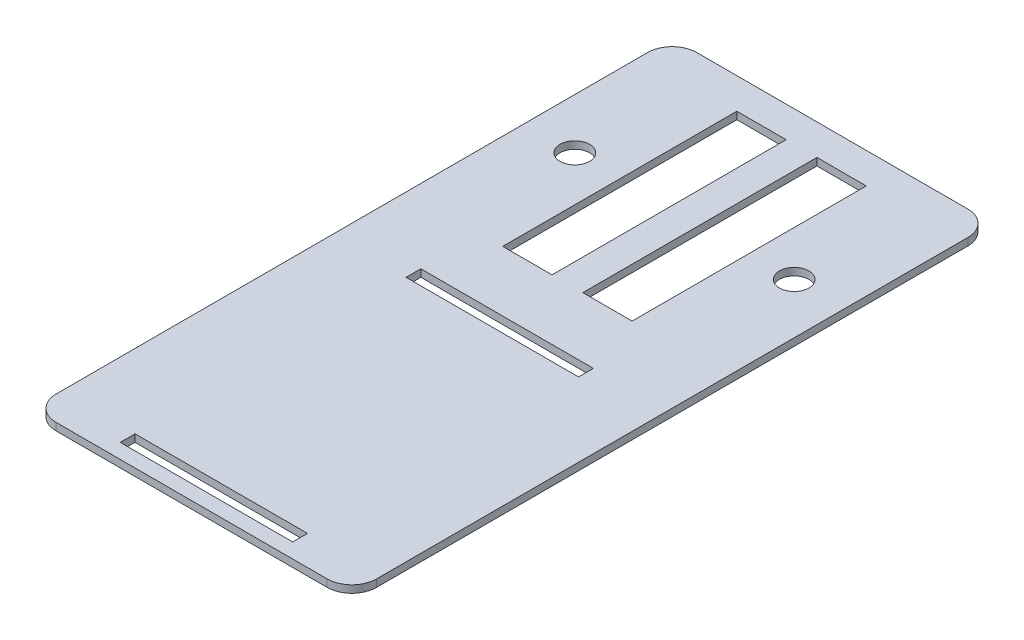
ISO-10303-21;
HEADER;
FILE_DESCRIPTION(('STEP AP214'),'2;1');
FILE_NAME('part.step','',(''),(''),'','','');
FILE_SCHEMA(('AUTOMOTIVE_DESIGN { 1 0 10303 214 1 1 1 1 }'));
ENDSEC;
DATA;
#1=APPLICATION_CONTEXT('core data for automotive mechanical design processes');
#2=APPLICATION_PROTOCOL_DEFINITION('international standard','automotive_design',2000,#1);
#3=PRODUCT_CONTEXT('',#1,'mechanical');
#4=PRODUCT('Part','Part','',(#3));
#5=PRODUCT_RELATED_PRODUCT_CATEGORY('part','',(#4));
#6=PRODUCT_DEFINITION_FORMATION('','',#4);
#7=PRODUCT_DEFINITION_CONTEXT('part definition',#1,'design');
#8=PRODUCT_DEFINITION('design','',#6,#7);
#9=PRODUCT_DEFINITION_SHAPE('','',#8);
#10=(LENGTH_UNIT() NAMED_UNIT(*) SI_UNIT(.MILLI.,.METRE.));
#11=(NAMED_UNIT(*) PLANE_ANGLE_UNIT() SI_UNIT($,.RADIAN.));
#12=(NAMED_UNIT(*) SI_UNIT($,.STERADIAN.) SOLID_ANGLE_UNIT());
#13=UNCERTAINTY_MEASURE_WITH_UNIT(LENGTH_MEASURE(1.E-05),#10,'distance_accuracy_value','');
#14=(GEOMETRIC_REPRESENTATION_CONTEXT(3) GLOBAL_UNCERTAINTY_ASSIGNED_CONTEXT((#13)) GLOBAL_UNIT_ASSIGNED_CONTEXT((#10,
#11,#12)) REPRESENTATION_CONTEXT('',''));
#15=CARTESIAN_POINT('',(0.,0.,0.));
#16=DIRECTION('',(0.,0.,1.));
#17=DIRECTION('',(1.,0.,0.));
#18=AXIS2_PLACEMENT_3D('',#15,#16,#17);
#19=CARTESIAN_POINT('',(0.,3.,0.));
#20=DIRECTION('',(0.,-1.,0.));
#21=DIRECTION('',(0.,0.,-1.));
#22=AXIS2_PLACEMENT_3D('',#19,#20,#21);
#23=PLANE('',#22);
#24=DIRECTION('',(1.,0.,0.));
#25=VECTOR('',#24,1.);
#26=CARTESIAN_POINT('',(0.,3.,72.));
#27=LINE('',#26,#25);
#28=CARTESIAN_POINT('',(-35.,3.,72.));
#29=VERTEX_POINT('',#28);
#30=CARTESIAN_POINT('',(35.,3.,72.));
#31=VERTEX_POINT('',#30);
#32=EDGE_CURVE('E266',#29,#31,#27,.T.);
#33=ORIENTED_EDGE('',*,*,#32,.T.);
#34=DIRECTION('',(0.,0.,1.));
#35=VECTOR('',#34,1.);
#36=CARTESIAN_POINT('',(35.,3.,0.));
#37=LINE('',#36,#35);
#38=CARTESIAN_POINT('',(35.,3.,78.));
#39=VERTEX_POINT('',#38);
#40=EDGE_CURVE('E203',#31,#39,#37,.T.);
#41=ORIENTED_EDGE('',*,*,#40,.T.);
#42=DIRECTION('',(-1.,0.,0.));
#43=VECTOR('',#42,1.);
#44=CARTESIAN_POINT('',(0.,3.,78.));
#45=LINE('',#44,#43);
#46=CARTESIAN_POINT('',(-35.,3.,78.));
#47=VERTEX_POINT('',#46);
#48=EDGE_CURVE('E271',#39,#47,#45,.T.);
#49=ORIENTED_EDGE('',*,*,#48,.T.);
#50=DIRECTION('',(0.,0.,-1.));
#51=VECTOR('',#50,1.);
#52=CARTESIAN_POINT('',(-35.,3.,0.));
#53=LINE('',#52,#51);
#54=EDGE_CURVE('E268',#47,#29,#53,.T.);
#55=ORIENTED_EDGE('',*,*,#54,.T.);
#56=EDGE_LOOP('',(#33,#41,#49,#55));
#57=FACE_BOUND('',#56,.T.);
#58=DIRECTION('',(1.,0.,0.));
#59=VECTOR('',#58,1.);
#60=CARTESIAN_POINT('',(0.,3.,188.));
#61=LINE('',#60,#59);
#62=CARTESIAN_POINT('',(-35.,3.,188.));
#63=VERTEX_POINT('',#62);
#64=CARTESIAN_POINT('',(35.,3.,188.));
#65=VERTEX_POINT('',#64);
#66=EDGE_CURVE('E231',#63,#65,#61,.T.);
#67=ORIENTED_EDGE('',*,*,#66,.T.);
#68=DIRECTION('',(0.,0.,1.));
#69=VECTOR('',#68,1.);
#70=CARTESIAN_POINT('',(35.,3.,0.));
#71=LINE('',#70,#69);
#72=CARTESIAN_POINT('',(35.,3.,194.));
#73=VERTEX_POINT('',#72);
#74=EDGE_CURVE('E263',#65,#73,#71,.T.);
#75=ORIENTED_EDGE('',*,*,#74,.T.);
#76=DIRECTION('',(-1.,0.,0.));
#77=VECTOR('',#76,1.);
#78=CARTESIAN_POINT('',(0.,3.,194.));
#79=LINE('',#78,#77);
#80=CARTESIAN_POINT('',(-35.,3.,194.));
#81=VERTEX_POINT('',#80);
#82=EDGE_CURVE('E260',#73,#81,#79,.T.);
#83=ORIENTED_EDGE('',*,*,#82,.T.);
#84=DIRECTION('',(0.,0.,-1.));
#85=VECTOR('',#84,1.);
#86=CARTESIAN_POINT('',(-35.,3.,0.));
#87=LINE('',#86,#85);
#88=EDGE_CURVE('E257',#81,#63,#87,.T.);
#89=ORIENTED_EDGE('',*,*,#88,.T.);
#90=EDGE_LOOP('',(#67,#75,#83,#89));
#91=FACE_BOUND('',#90,.T.);
#92=CARTESIAN_POINT('',(-44.5,3.,0.));
#93=DIRECTION('',(0.,-1.,0.));
#94=DIRECTION('',(0.,0.,-1.));
#95=AXIS2_PLACEMENT_3D('',#92,#93,#94);
#96=CIRCLE('',#95,6.);
#97=CARTESIAN_POINT('',(-44.5,3.,-6.));
#98=VERTEX_POINT('',#97);
#99=EDGE_CURVE('E284',#98,#98,#96,.F.);
#100=ORIENTED_EDGE('',*,*,#99,.F.);
#101=EDGE_LOOP('',(#100));
#102=FACE_BOUND('',#101,.T.);
#103=CARTESIAN_POINT('',(44.5,3.,0.));
#104=DIRECTION('',(0.,-1.,0.));
#105=DIRECTION('',(0.,0.,-1.));
#106=AXIS2_PLACEMENT_3D('',#103,#104,#105);
#107=CIRCLE('',#106,6.);
#108=CARTESIAN_POINT('',(44.5,3.,-6.));
#109=VERTEX_POINT('',#108);
#110=EDGE_CURVE('E290',#109,#109,#107,.T.);
#111=ORIENTED_EDGE('',*,*,#110,.T.);
#112=EDGE_LOOP('',(#111));
#113=FACE_BOUND('',#112,.T.);
#114=DIRECTION('',(0.,0.,1.));
#115=VECTOR('',#114,1.);
#116=CARTESIAN_POINT('',(-65.,3.,60.));
#117=LINE('',#116,#115);
#118=CARTESIAN_POINT('',(-65.,3.,-50.));
#119=VERTEX_POINT('',#118);
#120=CARTESIAN_POINT('',(-65.,3.,190.));
#121=VERTEX_POINT('',#120);
#122=EDGE_CURVE('E363',#119,#121,#117,.T.);
#123=ORIENTED_EDGE('',*,*,#122,.T.);
#124=CARTESIAN_POINT('',(-55.,3.,190.));
#125=DIRECTION('',(0.,-1.,0.));
#126=DIRECTION('',(0.,0.,-1.));
#127=AXIS2_PLACEMENT_3D('',#124,#125,#126);
#128=CIRCLE('',#127,10.);
#129=CARTESIAN_POINT('',(-55.,3.,200.));
#130=VERTEX_POINT('',#129);
#131=EDGE_CURVE('E396',#121,#130,#128,.F.);
#132=ORIENTED_EDGE('',*,*,#131,.T.);
#133=DIRECTION('',(-1.,0.,0.));
#134=VECTOR('',#133,1.);
#135=CARTESIAN_POINT('',(65.,3.,200.));
#136=LINE('',#135,#134);
#137=CARTESIAN_POINT('',(55.,3.,200.));
#138=VERTEX_POINT('',#137);
#139=EDGE_CURVE('E278',#138,#130,#136,.T.);
#140=ORIENTED_EDGE('',*,*,#139,.F.);
#141=CARTESIAN_POINT('',(55.,3.,190.));
#142=DIRECTION('',(0.,-1.,0.));
#143=DIRECTION('',(0.,0.,-1.));
#144=AXIS2_PLACEMENT_3D('',#141,#142,#143);
#145=CIRCLE('',#144,10.);
#146=CARTESIAN_POINT('',(65.,3.,190.));
#147=VERTEX_POINT('',#146);
#148=EDGE_CURVE('E394',#138,#147,#145,.F.);
#149=ORIENTED_EDGE('',*,*,#148,.T.);
#150=DIRECTION('',(0.,0.,-1.));
#151=VECTOR('',#150,1.);
#152=CARTESIAN_POINT('',(65.,3.,60.));
#153=LINE('',#152,#151);
#154=CARTESIAN_POINT('',(65.,3.,-50.));
#155=VERTEX_POINT('',#154);
#156=EDGE_CURVE('E358',#147,#155,#153,.T.);
#157=ORIENTED_EDGE('',*,*,#156,.T.);
#158=CARTESIAN_POINT('',(55.,3.,-50.));
#159=DIRECTION('',(0.,-1.,0.));
#160=DIRECTION('',(0.,0.,-1.));
#161=AXIS2_PLACEMENT_3D('',#158,#159,#160);
#162=CIRCLE('',#161,10.);
#163=CARTESIAN_POINT('',(55.,3.,-60.));
#164=VERTEX_POINT('',#163);
#165=EDGE_CURVE('E54',#155,#164,#162,.F.);
#166=ORIENTED_EDGE('',*,*,#165,.T.);
#167=DIRECTION('',(-1.,0.,0.));
#168=VECTOR('',#167,1.);
#169=CARTESIAN_POINT('',(-65.,3.,-60.));
#170=LINE('',#169,#168);
#171=CARTESIAN_POINT('',(-55.,3.,-60.));
#172=VERTEX_POINT('',#171);
#173=EDGE_CURVE('E360',#164,#172,#170,.T.);
#174=ORIENTED_EDGE('',*,*,#173,.T.);
#175=CARTESIAN_POINT('',(-55.,3.,-50.));
#176=DIRECTION('',(0.,-1.,0.));
#177=DIRECTION('',(0.,0.,-1.));
#178=AXIS2_PLACEMENT_3D('',#175,#176,#177);
#179=CIRCLE('',#178,10.);
#180=EDGE_CURVE('E391',#172,#119,#179,.F.);
#181=ORIENTED_EDGE('',*,*,#180,.T.);
#182=EDGE_LOOP('',(#123,#132,#140,#149,#157,#166,#174,#181));
#183=FACE_BOUND('',#182,.T.);
#184=DIRECTION('',(1.,0.,0.));
#185=VECTOR('',#184,1.);
#186=CARTESIAN_POINT('',(0.,3.,-47.5));
#187=LINE('',#186,#185);
#188=CARTESIAN_POINT('',(-26.25,3.,-47.5));
#189=VERTEX_POINT('',#188);
#190=CARTESIAN_POINT('',(-6.25,3.,-47.5));
#191=VERTEX_POINT('',#190);
#192=EDGE_CURVE('E338',#189,#191,#187,.T.);
#193=ORIENTED_EDGE('',*,*,#192,.T.);
#194=DIRECTION('',(0.,0.,1.));
#195=VECTOR('',#194,1.);
#196=CARTESIAN_POINT('',(-6.25,3.,0.));
#197=LINE('',#196,#195);
#198=CARTESIAN_POINT('',(-6.25,3.,47.5));
#199=VERTEX_POINT('',#198);
#200=EDGE_CURVE('E354',#191,#199,#197,.T.);
#201=ORIENTED_EDGE('',*,*,#200,.T.);
#202=DIRECTION('',(-1.,0.,0.));
#203=VECTOR('',#202,1.);
#204=CARTESIAN_POINT('',(0.,3.,47.5));
#205=LINE('',#204,#203);
#206=CARTESIAN_POINT('',(-26.25,3.,47.5));
#207=VERTEX_POINT('',#206);
#208=EDGE_CURVE('E351',#199,#207,#205,.T.);
#209=ORIENTED_EDGE('',*,*,#208,.T.);
#210=DIRECTION('',(0.,0.,-1.));
#211=VECTOR('',#210,1.);
#212=CARTESIAN_POINT('',(-26.25,3.,0.));
#213=LINE('',#212,#211);
#214=EDGE_CURVE('E348',#207,#189,#213,.T.);
#215=ORIENTED_EDGE('',*,*,#214,.T.);
#216=EDGE_LOOP('',(#193,#201,#209,#215));
#217=FACE_BOUND('',#216,.T.);
#218=DIRECTION('',(0.,0.,1.));
#219=VECTOR('',#218,1.);
#220=CARTESIAN_POINT('',(6.25,3.,0.));
#221=LINE('',#220,#219);
#222=CARTESIAN_POINT('',(6.25,3.,-47.5));
#223=VERTEX_POINT('',#222);
#224=CARTESIAN_POINT('',(6.25,3.,47.5));
#225=VERTEX_POINT('',#224);
#226=EDGE_CURVE('E319',#223,#225,#221,.T.);
#227=ORIENTED_EDGE('',*,*,#226,.F.);
#228=DIRECTION('',(-1.,0.,0.));
#229=VECTOR('',#228,1.);
#230=CARTESIAN_POINT('',(0.,3.,-47.5));
#231=LINE('',#230,#229);
#232=CARTESIAN_POINT('',(26.25,3.,-47.5));
#233=VERTEX_POINT('',#232);
#234=EDGE_CURVE('E317',#233,#223,#231,.T.);
#235=ORIENTED_EDGE('',*,*,#234,.F.);
#236=DIRECTION('',(0.,0.,-1.));
#237=VECTOR('',#236,1.);
#238=CARTESIAN_POINT('',(26.25,3.,0.));
#239=LINE('',#238,#237);
#240=CARTESIAN_POINT('',(26.25,3.,47.5));
#241=VERTEX_POINT('',#240);
#242=EDGE_CURVE('E315',#241,#233,#239,.T.);
#243=ORIENTED_EDGE('',*,*,#242,.F.);
#244=DIRECTION('',(1.,0.,0.));
#245=VECTOR('',#244,1.);
#246=CARTESIAN_POINT('',(0.,3.,47.5));
#247=LINE('',#246,#245);
#248=EDGE_CURVE('E306',#225,#241,#247,.T.);
#249=ORIENTED_EDGE('',*,*,#248,.F.);
#250=EDGE_LOOP('',(#227,#235,#243,#249));
#251=FACE_BOUND('',#250,.T.);
#252=ADVANCED_FACE('F33',(#57,#91,#102,#113,#183,#217,#251),#23,.F.);
#253=CARTESIAN_POINT('',(0.,0.,0.));
#254=DIRECTION('',(0.,-1.,0.));
#255=DIRECTION('',(0.,0.,-1.));
#256=AXIS2_PLACEMENT_3D('',#253,#254,#255);
#257=PLANE('',#256);
#258=DIRECTION('',(0.,0.,-1.));
#259=VECTOR('',#258,1.);
#260=CARTESIAN_POINT('',(35.,0.,78.));
#261=LINE('',#260,#259);
#262=CARTESIAN_POINT('',(35.,0.,78.));
#263=VERTEX_POINT('',#262);
#264=CARTESIAN_POINT('',(35.,0.,72.));
#265=VERTEX_POINT('',#264);
#266=EDGE_CURVE('E200',#263,#265,#261,.T.);
#267=ORIENTED_EDGE('',*,*,#266,.T.);
#268=DIRECTION('',(-1.,0.,0.));
#269=VECTOR('',#268,1.);
#270=CARTESIAN_POINT('',(-35.,0.,72.));
#271=LINE('',#270,#269);
#272=CARTESIAN_POINT('',(-35.,0.,72.));
#273=VERTEX_POINT('',#272);
#274=EDGE_CURVE('E211',#265,#273,#271,.T.);
#275=ORIENTED_EDGE('',*,*,#274,.T.);
#276=DIRECTION('',(0.,0.,1.));
#277=VECTOR('',#276,1.);
#278=CARTESIAN_POINT('',(-35.,0.,78.));
#279=LINE('',#278,#277);
#280=CARTESIAN_POINT('',(-35.,0.,78.));
#281=VERTEX_POINT('',#280);
#282=EDGE_CURVE('E216',#273,#281,#279,.T.);
#283=ORIENTED_EDGE('',*,*,#282,.T.);
#284=DIRECTION('',(1.,0.,0.));
#285=VECTOR('',#284,1.);
#286=CARTESIAN_POINT('',(-35.,0.,78.));
#287=LINE('',#286,#285);
#288=EDGE_CURVE('E207',#281,#263,#287,.T.);
#289=ORIENTED_EDGE('',*,*,#288,.T.);
#290=EDGE_LOOP('',(#267,#275,#283,#289));
#291=FACE_BOUND('',#290,.T.);
#292=DIRECTION('',(0.,0.,-1.));
#293=VECTOR('',#292,1.);
#294=CARTESIAN_POINT('',(35.,0.,194.));
#295=LINE('',#294,#293);
#296=CARTESIAN_POINT('',(35.,0.,194.));
#297=VERTEX_POINT('',#296);
#298=CARTESIAN_POINT('',(35.,0.,188.));
#299=VERTEX_POINT('',#298);
#300=EDGE_CURVE('E236',#297,#299,#295,.T.);
#301=ORIENTED_EDGE('',*,*,#300,.T.);
#302=DIRECTION('',(-1.,0.,0.));
#303=VECTOR('',#302,1.);
#304=CARTESIAN_POINT('',(-35.,0.,188.));
#305=LINE('',#304,#303);
#306=CARTESIAN_POINT('',(-35.,0.,188.));
#307=VERTEX_POINT('',#306);
#308=EDGE_CURVE('E239',#299,#307,#305,.T.);
#309=ORIENTED_EDGE('',*,*,#308,.T.);
#310=DIRECTION('',(0.,0.,1.));
#311=VECTOR('',#310,1.);
#312=CARTESIAN_POINT('',(-35.,0.,194.));
#313=LINE('',#312,#311);
#314=CARTESIAN_POINT('',(-35.,0.,194.));
#315=VERTEX_POINT('',#314);
#316=EDGE_CURVE('E242',#307,#315,#313,.T.);
#317=ORIENTED_EDGE('',*,*,#316,.T.);
#318=DIRECTION('',(1.,0.,0.));
#319=VECTOR('',#318,1.);
#320=CARTESIAN_POINT('',(-35.,0.,194.));
#321=LINE('',#320,#319);
#322=EDGE_CURVE('E245',#315,#297,#321,.T.);
#323=ORIENTED_EDGE('',*,*,#322,.T.);
#324=EDGE_LOOP('',(#301,#309,#317,#323));
#325=FACE_BOUND('',#324,.T.);
#326=CARTESIAN_POINT('',(-44.5,0.,0.));
#327=DIRECTION('',(0.,-1.,0.));
#328=DIRECTION('',(0.,0.,1.));
#329=AXIS2_PLACEMENT_3D('',#326,#327,#328);
#330=CIRCLE('',#329,6.);
#331=CARTESIAN_POINT('',(-44.5,0.,6.));
#332=VERTEX_POINT('',#331);
#333=EDGE_CURVE('E281',#332,#332,#330,.T.);
#334=ORIENTED_EDGE('',*,*,#333,.F.);
#335=EDGE_LOOP('',(#334));
#336=FACE_BOUND('',#335,.T.);
#337=CARTESIAN_POINT('',(44.5,0.,0.));
#338=DIRECTION('',(0.,1.,0.));
#339=DIRECTION('',(0.,0.,1.));
#340=AXIS2_PLACEMENT_3D('',#337,#338,#339);
#341=CIRCLE('',#340,6.);
#342=CARTESIAN_POINT('',(44.5,0.,6.));
#343=VERTEX_POINT('',#342);
#344=EDGE_CURVE('E287',#343,#343,#341,.T.);
#345=ORIENTED_EDGE('',*,*,#344,.T.);
#346=EDGE_LOOP('',(#345));
#347=FACE_BOUND('',#346,.T.);
#348=DIRECTION('',(0.,0.,-1.));
#349=VECTOR('',#348,1.);
#350=CARTESIAN_POINT('',(-6.25,0.,47.5));
#351=LINE('',#350,#349);
#352=CARTESIAN_POINT('',(-6.25,0.,47.5));
#353=VERTEX_POINT('',#352);
#354=CARTESIAN_POINT('',(-6.25,0.,-47.5));
#355=VERTEX_POINT('',#354);
#356=EDGE_CURVE('E322',#353,#355,#351,.T.);
#357=ORIENTED_EDGE('',*,*,#356,.T.);
#358=DIRECTION('',(-1.,0.,0.));
#359=VECTOR('',#358,1.);
#360=CARTESIAN_POINT('',(-26.25,0.,-47.5));
#361=LINE('',#360,#359);
#362=CARTESIAN_POINT('',(-26.25,0.,-47.5));
#363=VERTEX_POINT('',#362);
#364=EDGE_CURVE('E325',#355,#363,#361,.T.);
#365=ORIENTED_EDGE('',*,*,#364,.T.);
#366=DIRECTION('',(0.,0.,1.));
#367=VECTOR('',#366,1.);
#368=CARTESIAN_POINT('',(-26.25,0.,47.5));
#369=LINE('',#368,#367);
#370=CARTESIAN_POINT('',(-26.25,0.,47.5));
#371=VERTEX_POINT('',#370);
#372=EDGE_CURVE('E328',#363,#371,#369,.T.);
#373=ORIENTED_EDGE('',*,*,#372,.T.);
#374=DIRECTION('',(1.,0.,0.));
#375=VECTOR('',#374,1.);
#376=CARTESIAN_POINT('',(-26.25,0.,47.5));
#377=LINE('',#376,#375);
#378=EDGE_CURVE('E331',#371,#353,#377,.T.);
#379=ORIENTED_EDGE('',*,*,#378,.T.);
#380=EDGE_LOOP('',(#357,#365,#373,#379));
#381=FACE_BOUND('',#380,.T.);
#382=DIRECTION('',(1.,0.,0.));
#383=VECTOR('',#382,1.);
#384=CARTESIAN_POINT('',(-65.,0.,200.));
#385=LINE('',#384,#383);
#386=CARTESIAN_POINT('',(-55.,0.,200.));
#387=VERTEX_POINT('',#386);
#388=CARTESIAN_POINT('',(55.,0.,200.));
#389=VERTEX_POINT('',#388);
#390=EDGE_CURVE('E275',#387,#389,#385,.T.);
#391=ORIENTED_EDGE('',*,*,#390,.F.);
#392=CARTESIAN_POINT('',(-55.,0.,190.));
#393=DIRECTION('',(0.,-1.,0.));
#394=DIRECTION('',(0.,0.,-1.));
#395=AXIS2_PLACEMENT_3D('',#392,#393,#394);
#396=CIRCLE('',#395,10.);
#397=CARTESIAN_POINT('',(-65.,0.,190.));
#398=VERTEX_POINT('',#397);
#399=EDGE_CURVE('E384',#387,#398,#396,.T.);
#400=ORIENTED_EDGE('',*,*,#399,.T.);
#401=DIRECTION('',(0.,0.,1.));
#402=VECTOR('',#401,1.);
#403=CARTESIAN_POINT('',(-65.,0.,60.));
#404=LINE('',#403,#402);
#405=CARTESIAN_POINT('',(-65.,0.,-50.));
#406=VERTEX_POINT('',#405);
#407=EDGE_CURVE('E361',#406,#398,#404,.T.);
#408=ORIENTED_EDGE('',*,*,#407,.F.);
#409=CARTESIAN_POINT('',(-55.,0.,-50.));
#410=DIRECTION('',(0.,-1.,0.));
#411=DIRECTION('',(0.,0.,-1.));
#412=AXIS2_PLACEMENT_3D('',#409,#410,#411);
#413=CIRCLE('',#412,10.);
#414=CARTESIAN_POINT('',(-55.,0.,-60.));
#415=VERTEX_POINT('',#414);
#416=EDGE_CURVE('E378',#406,#415,#413,.T.);
#417=ORIENTED_EDGE('',*,*,#416,.T.);
#418=DIRECTION('',(-1.,0.,0.));
#419=VECTOR('',#418,1.);
#420=CARTESIAN_POINT('',(-65.,0.,-60.));
#421=LINE('',#420,#419);
#422=CARTESIAN_POINT('',(55.,0.,-60.));
#423=VERTEX_POINT('',#422);
#424=EDGE_CURVE('E369',#423,#415,#421,.T.);
#425=ORIENTED_EDGE('',*,*,#424,.F.);
#426=CARTESIAN_POINT('',(55.,0.,-50.));
#427=DIRECTION('',(0.,-1.,0.));
#428=DIRECTION('',(0.,0.,-1.));
#429=AXIS2_PLACEMENT_3D('',#426,#427,#428);
#430=CIRCLE('',#429,10.);
#431=CARTESIAN_POINT('',(65.,0.,-50.));
#432=VERTEX_POINT('',#431);
#433=EDGE_CURVE('E380',#423,#432,#430,.T.);
#434=ORIENTED_EDGE('',*,*,#433,.T.);
#435=DIRECTION('',(0.,0.,-1.));
#436=VECTOR('',#435,1.);
#437=CARTESIAN_POINT('',(65.,0.,60.));
#438=LINE('',#437,#436);
#439=CARTESIAN_POINT('',(65.,0.,190.));
#440=VERTEX_POINT('',#439);
#441=EDGE_CURVE('E357',#440,#432,#438,.T.);
#442=ORIENTED_EDGE('',*,*,#441,.F.);
#443=CARTESIAN_POINT('',(55.,0.,190.));
#444=DIRECTION('',(0.,-1.,0.));
#445=DIRECTION('',(0.,0.,-1.));
#446=AXIS2_PLACEMENT_3D('',#443,#444,#445);
#447=CIRCLE('',#446,10.);
#448=EDGE_CURVE('E382',#440,#389,#447,.T.);
#449=ORIENTED_EDGE('',*,*,#448,.T.);
#450=EDGE_LOOP('',(#391,#400,#408,#417,#425,#434,#442,#449));
#451=FACE_BOUND('',#450,.T.);
#452=DIRECTION('',(1.,0.,0.));
#453=VECTOR('',#452,1.);
#454=CARTESIAN_POINT('',(26.25,0.,-47.5));
#455=LINE('',#454,#453);
#456=CARTESIAN_POINT('',(6.25,0.,-47.5));
#457=VERTEX_POINT('',#456);
#458=CARTESIAN_POINT('',(26.25,0.,-47.5));
#459=VERTEX_POINT('',#458);
#460=EDGE_CURVE('E300',#457,#459,#455,.T.);
#461=ORIENTED_EDGE('',*,*,#460,.F.);
#462=DIRECTION('',(0.,0.,-1.));
#463=VECTOR('',#462,1.);
#464=CARTESIAN_POINT('',(6.25,0.,47.5));
#465=LINE('',#464,#463);
#466=CARTESIAN_POINT('',(6.25,0.,47.5));
#467=VERTEX_POINT('',#466);
#468=EDGE_CURVE('E293',#467,#457,#465,.T.);
#469=ORIENTED_EDGE('',*,*,#468,.F.);
#470=DIRECTION('',(-1.,0.,0.));
#471=VECTOR('',#470,1.);
#472=CARTESIAN_POINT('',(26.25,0.,47.5));
#473=LINE('',#472,#471);
#474=CARTESIAN_POINT('',(26.25,0.,47.5));
#475=VERTEX_POINT('',#474);
#476=EDGE_CURVE('E295',#475,#467,#473,.T.);
#477=ORIENTED_EDGE('',*,*,#476,.F.);
#478=DIRECTION('',(0.,0.,1.));
#479=VECTOR('',#478,1.);
#480=CARTESIAN_POINT('',(26.25,0.,47.5));
#481=LINE('',#480,#479);
#482=EDGE_CURVE('E297',#459,#475,#481,.T.);
#483=ORIENTED_EDGE('',*,*,#482,.F.);
#484=EDGE_LOOP('',(#461,#469,#477,#483));
#485=FACE_BOUND('',#484,.T.);
#486=ADVANCED_FACE('F218',(#291,#325,#336,#347,#381,#451,#485),#257,.T.);
#487=CARTESIAN_POINT('',(65.,3.,60.));
#488=DIRECTION('',(-1.,0.,0.));
#489=DIRECTION('',(0.,0.,1.));
#490=AXIS2_PLACEMENT_3D('',#487,#488,#489);
#491=PLANE('',#490);
#492=ORIENTED_EDGE('',*,*,#156,.F.);
#493=DIRECTION('',(0.,1.,0.));
#494=VECTOR('',#493,1.);
#495=CARTESIAN_POINT('',(65.,0.,190.));
#496=LINE('',#495,#494);
#497=EDGE_CURVE('E400',#147,#440,#496,.F.);
#498=ORIENTED_EDGE('',*,*,#497,.T.);
#499=ORIENTED_EDGE('',*,*,#441,.T.);
#500=DIRECTION('',(0.,-1.,0.));
#501=VECTOR('',#500,1.);
#502=CARTESIAN_POINT('',(65.,3.,-50.));
#503=LINE('',#502,#501);
#504=EDGE_CURVE('E398',#432,#155,#503,.F.);
#505=ORIENTED_EDGE('',*,*,#504,.T.);
#506=EDGE_LOOP('',(#492,#498,#499,#505));
#507=FACE_BOUND('',#506,.T.);
#508=ADVANCED_FACE('F405',(#507),#491,.F.);
#509=CARTESIAN_POINT('',(-65.,3.,-60.));
#510=DIRECTION('',(0.,0.,1.));
#511=DIRECTION('',(1.,0.,0.));
#512=AXIS2_PLACEMENT_3D('',#509,#510,#511);
#513=PLANE('',#512);
#514=ORIENTED_EDGE('',*,*,#173,.F.);
#515=DIRECTION('',(0.,-1.,0.));
#516=VECTOR('',#515,1.);
#517=CARTESIAN_POINT('',(55.,3.,-60.));
#518=LINE('',#517,#516);
#519=EDGE_CURVE('E11',#164,#423,#518,.T.);
#520=ORIENTED_EDGE('',*,*,#519,.T.);
#521=ORIENTED_EDGE('',*,*,#424,.T.);
#522=DIRECTION('',(0.,-1.,0.));
#523=VECTOR('',#522,1.);
#524=CARTESIAN_POINT('',(-55.,3.,-60.));
#525=LINE('',#524,#523);
#526=EDGE_CURVE('E41',#415,#172,#525,.F.);
#527=ORIENTED_EDGE('',*,*,#526,.T.);
#528=EDGE_LOOP('',(#514,#520,#521,#527));
#529=FACE_BOUND('',#528,.T.);
#530=ADVANCED_FACE('F431',(#529),#513,.F.);
#531=CARTESIAN_POINT('',(-65.,3.,60.));
#532=DIRECTION('',(1.,0.,0.));
#533=DIRECTION('',(0.,0.,-1.));
#534=AXIS2_PLACEMENT_3D('',#531,#532,#533);
#535=PLANE('',#534);
#536=ORIENTED_EDGE('',*,*,#407,.T.);
#537=DIRECTION('',(0.,-1.,0.));
#538=VECTOR('',#537,1.);
#539=CARTESIAN_POINT('',(-65.,3.,190.));
#540=LINE('',#539,#538);
#541=EDGE_CURVE('E389',#398,#121,#540,.F.);
#542=ORIENTED_EDGE('',*,*,#541,.T.);
#543=ORIENTED_EDGE('',*,*,#122,.F.);
#544=DIRECTION('',(0.,-1.,0.));
#545=VECTOR('',#544,1.);
#546=CARTESIAN_POINT('',(-65.,3.,-50.));
#547=LINE('',#546,#545);
#548=EDGE_CURVE('E386',#119,#406,#547,.T.);
#549=ORIENTED_EDGE('',*,*,#548,.T.);
#550=EDGE_LOOP('',(#536,#542,#543,#549));
#551=FACE_BOUND('',#550,.T.);
#552=ADVANCED_FACE('F427',(#551),#535,.F.);
#553=CARTESIAN_POINT('',(-6.25,0.,47.5));
#554=DIRECTION('',(1.,0.,0.));
#555=DIRECTION('',(0.,0.,-1.));
#556=AXIS2_PLACEMENT_3D('',#553,#554,#555);
#557=PLANE('',#556);
#558=DIRECTION('',(0.,1.,0.));
#559=VECTOR('',#558,1.);
#560=CARTESIAN_POINT('',(-6.25,0.,-47.5));
#561=LINE('',#560,#559);
#562=EDGE_CURVE('E334',#355,#191,#561,.T.);
#563=ORIENTED_EDGE('',*,*,#562,.F.);
#564=ORIENTED_EDGE('',*,*,#356,.F.);
#565=DIRECTION('',(0.,1.,0.));
#566=VECTOR('',#565,1.);
#567=CARTESIAN_POINT('',(-6.25,0.,47.5));
#568=LINE('',#567,#566);
#569=EDGE_CURVE('E335',#353,#199,#568,.T.);
#570=ORIENTED_EDGE('',*,*,#569,.T.);
#571=ORIENTED_EDGE('',*,*,#200,.F.);
#572=EDGE_LOOP('',(#563,#564,#570,#571));
#573=FACE_BOUND('',#572,.T.);
#574=ADVANCED_FACE('F451',(#573),#557,.F.);
#575=CARTESIAN_POINT('',(-26.25,0.,47.5));
#576=DIRECTION('',(0.,0.,1.));
#577=DIRECTION('',(1.,0.,0.));
#578=AXIS2_PLACEMENT_3D('',#575,#576,#577);
#579=PLANE('',#578);
#580=ORIENTED_EDGE('',*,*,#569,.F.);
#581=ORIENTED_EDGE('',*,*,#378,.F.);
#582=DIRECTION('',(0.,1.,0.));
#583=VECTOR('',#582,1.);
#584=CARTESIAN_POINT('',(-26.25,0.,47.5));
#585=LINE('',#584,#583);
#586=EDGE_CURVE('E339',#371,#207,#585,.T.);
#587=ORIENTED_EDGE('',*,*,#586,.T.);
#588=ORIENTED_EDGE('',*,*,#208,.F.);
#589=EDGE_LOOP('',(#580,#581,#587,#588));
#590=FACE_BOUND('',#589,.T.);
#591=ADVANCED_FACE('F518',(#590),#579,.F.);
#592=CARTESIAN_POINT('',(-26.25,0.,47.5));
#593=DIRECTION('',(-1.,0.,0.));
#594=DIRECTION('',(0.,0.,1.));
#595=AXIS2_PLACEMENT_3D('',#592,#593,#594);
#596=PLANE('',#595);
#597=ORIENTED_EDGE('',*,*,#586,.F.);
#598=ORIENTED_EDGE('',*,*,#372,.F.);
#599=DIRECTION('',(0.,1.,0.));
#600=VECTOR('',#599,1.);
#601=CARTESIAN_POINT('',(-26.25,0.,-47.5));
#602=LINE('',#601,#600);
#603=EDGE_CURVE('E342',#363,#189,#602,.T.);
#604=ORIENTED_EDGE('',*,*,#603,.T.);
#605=ORIENTED_EDGE('',*,*,#214,.F.);
#606=EDGE_LOOP('',(#597,#598,#604,#605));
#607=FACE_BOUND('',#606,.T.);
#608=ADVANCED_FACE('F521',(#607),#596,.F.);
#609=CARTESIAN_POINT('',(-26.25,0.,-47.5));
#610=DIRECTION('',(0.,0.,-1.));
#611=DIRECTION('',(-1.,0.,0.));
#612=AXIS2_PLACEMENT_3D('',#609,#610,#611);
#613=PLANE('',#612);
#614=ORIENTED_EDGE('',*,*,#603,.F.);
#615=ORIENTED_EDGE('',*,*,#364,.F.);
#616=ORIENTED_EDGE('',*,*,#562,.T.);
#617=ORIENTED_EDGE('',*,*,#192,.F.);
#618=EDGE_LOOP('',(#614,#615,#616,#617));
#619=FACE_BOUND('',#618,.T.);
#620=ADVANCED_FACE('F516',(#619),#613,.F.);
#621=CARTESIAN_POINT('',(6.25,0.,47.5));
#622=DIRECTION('',(1.,0.,0.));
#623=DIRECTION('',(0.,0.,-1.));
#624=AXIS2_PLACEMENT_3D('',#621,#622,#623);
#625=PLANE('',#624);
#626=ORIENTED_EDGE('',*,*,#226,.T.);
#627=DIRECTION('',(0.,1.,0.));
#628=VECTOR('',#627,1.);
#629=CARTESIAN_POINT('',(6.25,0.,47.5));
#630=LINE('',#629,#628);
#631=EDGE_CURVE('E302',#467,#225,#630,.T.);
#632=ORIENTED_EDGE('',*,*,#631,.F.);
#633=ORIENTED_EDGE('',*,*,#468,.T.);
#634=DIRECTION('',(0.,1.,0.));
#635=VECTOR('',#634,1.);
#636=CARTESIAN_POINT('',(6.25,0.,-47.5));
#637=LINE('',#636,#635);
#638=EDGE_CURVE('E303',#457,#223,#637,.T.);
#639=ORIENTED_EDGE('',*,*,#638,.T.);
#640=EDGE_LOOP('',(#626,#632,#633,#639));
#641=FACE_BOUND('',#640,.T.);
#642=ADVANCED_FACE('F506',(#641),#625,.T.);
#643=CARTESIAN_POINT('',(26.25,0.,-47.5));
#644=DIRECTION('',(0.,0.,1.));
#645=DIRECTION('',(1.,0.,0.));
#646=AXIS2_PLACEMENT_3D('',#643,#644,#645);
#647=PLANE('',#646);
#648=ORIENTED_EDGE('',*,*,#234,.T.);
#649=ORIENTED_EDGE('',*,*,#638,.F.);
#650=ORIENTED_EDGE('',*,*,#460,.T.);
#651=DIRECTION('',(0.,1.,0.));
#652=VECTOR('',#651,1.);
#653=CARTESIAN_POINT('',(26.25,0.,-47.5));
#654=LINE('',#653,#652);
#655=EDGE_CURVE('E307',#459,#233,#654,.T.);
#656=ORIENTED_EDGE('',*,*,#655,.T.);
#657=EDGE_LOOP('',(#648,#649,#650,#656));
#658=FACE_BOUND('',#657,.T.);
#659=ADVANCED_FACE('F502',(#658),#647,.T.);
#660=CARTESIAN_POINT('',(26.25,0.,47.5));
#661=DIRECTION('',(-1.,0.,0.));
#662=DIRECTION('',(0.,0.,1.));
#663=AXIS2_PLACEMENT_3D('',#660,#661,#662);
#664=PLANE('',#663);
#665=ORIENTED_EDGE('',*,*,#242,.T.);
#666=ORIENTED_EDGE('',*,*,#655,.F.);
#667=ORIENTED_EDGE('',*,*,#482,.T.);
#668=DIRECTION('',(0.,1.,0.));
#669=VECTOR('',#668,1.);
#670=CARTESIAN_POINT('',(26.25,0.,47.5));
#671=LINE('',#670,#669);
#672=EDGE_CURVE('E310',#475,#241,#671,.T.);
#673=ORIENTED_EDGE('',*,*,#672,.T.);
#674=EDGE_LOOP('',(#665,#666,#667,#673));
#675=FACE_BOUND('',#674,.T.);
#676=ADVANCED_FACE('F505',(#675),#664,.T.);
#677=CARTESIAN_POINT('',(26.25,0.,47.5));
#678=DIRECTION('',(0.,0.,-1.));
#679=DIRECTION('',(-1.,0.,0.));
#680=AXIS2_PLACEMENT_3D('',#677,#678,#679);
#681=PLANE('',#680);
#682=ORIENTED_EDGE('',*,*,#248,.T.);
#683=ORIENTED_EDGE('',*,*,#672,.F.);
#684=ORIENTED_EDGE('',*,*,#476,.T.);
#685=ORIENTED_EDGE('',*,*,#631,.T.);
#686=EDGE_LOOP('',(#682,#683,#684,#685));
#687=FACE_BOUND('',#686,.T.);
#688=ADVANCED_FACE('F500',(#687),#681,.T.);
#689=CARTESIAN_POINT('',(44.5,0.,0.));
#690=DIRECTION('',(0.,1.,0.));
#691=DIRECTION('',(0.,0.,1.));
#692=AXIS2_PLACEMENT_3D('',#689,#690,#691);
#693=CYLINDRICAL_SURFACE('',#692,6.);
#694=ORIENTED_EDGE('',*,*,#344,.F.);
#695=EDGE_LOOP('',(#694));
#696=FACE_BOUND('',#695,.T.);
#697=ORIENTED_EDGE('',*,*,#110,.F.);
#698=EDGE_LOOP('',(#697));
#699=FACE_BOUND('',#698,.T.);
#700=ADVANCED_FACE('F496',(#696,#699),#693,.F.);
#701=CARTESIAN_POINT('',(-44.5,0.,0.));
#702=DIRECTION('',(0.,1.,0.));
#703=DIRECTION('',(0.,0.,1.));
#704=AXIS2_PLACEMENT_3D('',#701,#702,#703);
#705=CYLINDRICAL_SURFACE('',#704,6.);
#706=ORIENTED_EDGE('',*,*,#333,.T.);
#707=EDGE_LOOP('',(#706));
#708=FACE_BOUND('',#707,.T.);
#709=ORIENTED_EDGE('',*,*,#99,.T.);
#710=EDGE_LOOP('',(#709));
#711=FACE_BOUND('',#710,.T.);
#712=ADVANCED_FACE('F494',(#708,#711),#705,.F.);
#713=CARTESIAN_POINT('',(0.,0.,200.));
#714=DIRECTION('',(0.,0.,1.));
#715=DIRECTION('',(1.,0.,0.));
#716=AXIS2_PLACEMENT_3D('',#713,#714,#715);
#717=PLANE('',#716);
#718=ORIENTED_EDGE('',*,*,#139,.T.);
#719=DIRECTION('',(0.,-1.,0.));
#720=VECTOR('',#719,1.);
#721=CARTESIAN_POINT('',(-55.,0.,200.));
#722=LINE('',#721,#720);
#723=EDGE_CURVE('E375',#130,#387,#722,.T.);
#724=ORIENTED_EDGE('',*,*,#723,.T.);
#725=ORIENTED_EDGE('',*,*,#390,.T.);
#726=DIRECTION('',(0.,1.,0.));
#727=VECTOR('',#726,1.);
#728=CARTESIAN_POINT('',(55.,3.,200.));
#729=LINE('',#728,#727);
#730=EDGE_CURVE('E366',#389,#138,#729,.T.);
#731=ORIENTED_EDGE('',*,*,#730,.T.);
#732=EDGE_LOOP('',(#718,#724,#725,#731));
#733=FACE_BOUND('',#732,.T.);
#734=ADVANCED_FACE('F417',(#733),#717,.T.);
#735=CARTESIAN_POINT('',(35.,0.,194.));
#736=DIRECTION('',(1.,0.,0.));
#737=DIRECTION('',(0.,0.,-1.));
#738=AXIS2_PLACEMENT_3D('',#735,#736,#737);
#739=PLANE('',#738);
#740=DIRECTION('',(0.,1.,0.));
#741=VECTOR('',#740,1.);
#742=CARTESIAN_POINT('',(35.,0.,188.));
#743=LINE('',#742,#741);
#744=EDGE_CURVE('E247',#299,#65,#743,.T.);
#745=ORIENTED_EDGE('',*,*,#744,.F.);
#746=ORIENTED_EDGE('',*,*,#300,.F.);
#747=DIRECTION('',(0.,1.,0.));
#748=VECTOR('',#747,1.);
#749=CARTESIAN_POINT('',(35.,0.,194.));
#750=LINE('',#749,#748);
#751=EDGE_CURVE('E221',#297,#73,#750,.T.);
#752=ORIENTED_EDGE('',*,*,#751,.T.);
#753=ORIENTED_EDGE('',*,*,#74,.F.);
#754=EDGE_LOOP('',(#745,#746,#752,#753));
#755=FACE_BOUND('',#754,.T.);
#756=ADVANCED_FACE('F481',(#755),#739,.F.);
#757=CARTESIAN_POINT('',(-35.,0.,194.));
#758=DIRECTION('',(0.,0.,1.));
#759=DIRECTION('',(1.,0.,0.));
#760=AXIS2_PLACEMENT_3D('',#757,#758,#759);
#761=PLANE('',#760);
#762=ORIENTED_EDGE('',*,*,#751,.F.);
#763=ORIENTED_EDGE('',*,*,#322,.F.);
#764=DIRECTION('',(0.,1.,0.));
#765=VECTOR('',#764,1.);
#766=CARTESIAN_POINT('',(-35.,0.,194.));
#767=LINE('',#766,#765);
#768=EDGE_CURVE('E224',#315,#81,#767,.T.);
#769=ORIENTED_EDGE('',*,*,#768,.T.);
#770=ORIENTED_EDGE('',*,*,#82,.F.);
#771=EDGE_LOOP('',(#762,#763,#769,#770));
#772=FACE_BOUND('',#771,.T.);
#773=ADVANCED_FACE('F477',(#772),#761,.F.);
#774=CARTESIAN_POINT('',(-35.,0.,194.));
#775=DIRECTION('',(-1.,0.,0.));
#776=DIRECTION('',(0.,0.,1.));
#777=AXIS2_PLACEMENT_3D('',#774,#775,#776);
#778=PLANE('',#777);
#779=ORIENTED_EDGE('',*,*,#768,.F.);
#780=ORIENTED_EDGE('',*,*,#316,.F.);
#781=DIRECTION('',(0.,1.,0.));
#782=VECTOR('',#781,1.);
#783=CARTESIAN_POINT('',(-35.,0.,188.));
#784=LINE('',#783,#782);
#785=EDGE_CURVE('E251',#307,#63,#784,.T.);
#786=ORIENTED_EDGE('',*,*,#785,.T.);
#787=ORIENTED_EDGE('',*,*,#88,.F.);
#788=EDGE_LOOP('',(#779,#780,#786,#787));
#789=FACE_BOUND('',#788,.T.);
#790=ADVANCED_FACE('F480',(#789),#778,.F.);
#791=CARTESIAN_POINT('',(-35.,0.,188.));
#792=DIRECTION('',(0.,0.,-1.));
#793=DIRECTION('',(-1.,0.,0.));
#794=AXIS2_PLACEMENT_3D('',#791,#792,#793);
#795=PLANE('',#794);
#796=ORIENTED_EDGE('',*,*,#785,.F.);
#797=ORIENTED_EDGE('',*,*,#308,.F.);
#798=ORIENTED_EDGE('',*,*,#744,.T.);
#799=ORIENTED_EDGE('',*,*,#66,.F.);
#800=EDGE_LOOP('',(#796,#797,#798,#799));
#801=FACE_BOUND('',#800,.T.);
#802=ADVANCED_FACE('F476',(#801),#795,.F.);
#803=CARTESIAN_POINT('',(35.,0.,78.));
#804=DIRECTION('',(1.,0.,0.));
#805=DIRECTION('',(0.,0.,-1.));
#806=AXIS2_PLACEMENT_3D('',#803,#804,#805);
#807=PLANE('',#806);
#808=DIRECTION('',(0.,1.,0.));
#809=VECTOR('',#808,1.);
#810=CARTESIAN_POINT('',(35.,0.,72.));
#811=LINE('',#810,#809);
#812=EDGE_CURVE('E195',#265,#31,#811,.T.);
#813=ORIENTED_EDGE('',*,*,#812,.F.);
#814=ORIENTED_EDGE('',*,*,#266,.F.);
#815=DIRECTION('',(0.,1.,0.));
#816=VECTOR('',#815,1.);
#817=CARTESIAN_POINT('',(35.,0.,78.));
#818=LINE('',#817,#816);
#819=EDGE_CURVE('E229',#263,#39,#818,.T.);
#820=ORIENTED_EDGE('',*,*,#819,.T.);
#821=ORIENTED_EDGE('',*,*,#40,.F.);
#822=EDGE_LOOP('',(#813,#814,#820,#821));
#823=FACE_BOUND('',#822,.T.);
#824=ADVANCED_FACE('F197',(#823),#807,.F.);
#825=CARTESIAN_POINT('',(-35.,0.,78.));
#826=DIRECTION('',(0.,0.,1.));
#827=DIRECTION('',(1.,0.,0.));
#828=AXIS2_PLACEMENT_3D('',#825,#826,#827);
#829=PLANE('',#828);
#830=ORIENTED_EDGE('',*,*,#819,.F.);
#831=ORIENTED_EDGE('',*,*,#288,.F.);
#832=DIRECTION('',(0.,1.,0.));
#833=VECTOR('',#832,1.);
#834=CARTESIAN_POINT('',(-35.,0.,78.));
#835=LINE('',#834,#833);
#836=EDGE_CURVE('E232',#281,#47,#835,.T.);
#837=ORIENTED_EDGE('',*,*,#836,.T.);
#838=ORIENTED_EDGE('',*,*,#48,.F.);
#839=EDGE_LOOP('',(#830,#831,#837,#838));
#840=FACE_BOUND('',#839,.T.);
#841=ADVANCED_FACE('F469',(#840),#829,.F.);
#842=CARTESIAN_POINT('',(-35.,0.,78.));
#843=DIRECTION('',(-1.,0.,0.));
#844=DIRECTION('',(0.,0.,1.));
#845=AXIS2_PLACEMENT_3D('',#842,#843,#844);
#846=PLANE('',#845);
#847=ORIENTED_EDGE('',*,*,#836,.F.);
#848=ORIENTED_EDGE('',*,*,#282,.F.);
#849=DIRECTION('',(0.,1.,0.));
#850=VECTOR('',#849,1.);
#851=CARTESIAN_POINT('',(-35.,0.,72.));
#852=LINE('',#851,#850);
#853=EDGE_CURVE('E206',#273,#29,#852,.T.);
#854=ORIENTED_EDGE('',*,*,#853,.T.);
#855=ORIENTED_EDGE('',*,*,#54,.F.);
#856=EDGE_LOOP('',(#847,#848,#854,#855));
#857=FACE_BOUND('',#856,.T.);
#858=ADVANCED_FACE('F464',(#857),#846,.F.);
#859=CARTESIAN_POINT('',(-35.,0.,72.));
#860=DIRECTION('',(0.,0.,-1.));
#861=DIRECTION('',(-1.,0.,0.));
#862=AXIS2_PLACEMENT_3D('',#859,#860,#861);
#863=PLANE('',#862);
#864=ORIENTED_EDGE('',*,*,#853,.F.);
#865=ORIENTED_EDGE('',*,*,#274,.F.);
#866=ORIENTED_EDGE('',*,*,#812,.T.);
#867=ORIENTED_EDGE('',*,*,#32,.F.);
#868=EDGE_LOOP('',(#864,#865,#866,#867));
#869=FACE_BOUND('',#868,.T.);
#870=ADVANCED_FACE('F212',(#869),#863,.F.);
#871=CARTESIAN_POINT('',(-55.,0.,190.));
#872=DIRECTION('',(0.,1.,0.));
#873=DIRECTION('',(0.,0.,1.));
#874=AXIS2_PLACEMENT_3D('',#871,#872,#873);
#875=CYLINDRICAL_SURFACE('',#874,10.);
#876=ORIENTED_EDGE('',*,*,#131,.F.);
#877=ORIENTED_EDGE('',*,*,#541,.F.);
#878=ORIENTED_EDGE('',*,*,#399,.F.);
#879=ORIENTED_EDGE('',*,*,#723,.F.);
#880=EDGE_LOOP('',(#876,#877,#878,#879));
#881=FACE_BOUND('',#880,.T.);
#882=ADVANCED_FACE('F424',(#881),#875,.T.);
#883=CARTESIAN_POINT('',(55.,0.,190.));
#884=DIRECTION('',(0.,-1.,0.));
#885=DIRECTION('',(0.,0.,-1.));
#886=AXIS2_PLACEMENT_3D('',#883,#884,#885);
#887=CYLINDRICAL_SURFACE('',#886,10.);
#888=ORIENTED_EDGE('',*,*,#448,.F.);
#889=ORIENTED_EDGE('',*,*,#497,.F.);
#890=ORIENTED_EDGE('',*,*,#148,.F.);
#891=ORIENTED_EDGE('',*,*,#730,.F.);
#892=EDGE_LOOP('',(#888,#889,#890,#891));
#893=FACE_BOUND('',#892,.T.);
#894=ADVANCED_FACE('F414',(#893),#887,.T.);
#895=CARTESIAN_POINT('',(55.,3.,-50.));
#896=DIRECTION('',(0.,-1.,0.));
#897=DIRECTION('',(0.,0.,-1.));
#898=AXIS2_PLACEMENT_3D('',#895,#896,#897);
#899=CYLINDRICAL_SURFACE('',#898,10.);
#900=ORIENTED_EDGE('',*,*,#165,.F.);
#901=ORIENTED_EDGE('',*,*,#504,.F.);
#902=ORIENTED_EDGE('',*,*,#433,.F.);
#903=ORIENTED_EDGE('',*,*,#519,.F.);
#904=EDGE_LOOP('',(#900,#901,#902,#903));
#905=FACE_BOUND('',#904,.T.);
#906=ADVANCED_FACE('F434',(#905),#899,.T.);
#907=CARTESIAN_POINT('',(-55.,3.,-50.));
#908=DIRECTION('',(0.,-1.,0.));
#909=DIRECTION('',(0.,0.,-1.));
#910=AXIS2_PLACEMENT_3D('',#907,#908,#909);
#911=CYLINDRICAL_SURFACE('',#910,10.);
#912=ORIENTED_EDGE('',*,*,#180,.F.);
#913=ORIENTED_EDGE('',*,*,#526,.F.);
#914=ORIENTED_EDGE('',*,*,#416,.F.);
#915=ORIENTED_EDGE('',*,*,#548,.F.);
#916=EDGE_LOOP('',(#912,#913,#914,#915));
#917=FACE_BOUND('',#916,.T.);
#918=ADVANCED_FACE('F35',(#917),#911,.T.);
#919=CLOSED_SHELL('',(#252,#486,#508,#530,#552,#574,#591,#608,#620,#642,#659,#676,#688,#700,
#712,#734,#756,#773,#790,#802,#824,#841,#858,#870,#882,#894,#906,#918));
#920=MANIFOLD_SOLID_BREP('B2',#919);
#921=ADVANCED_BREP_SHAPE_REPRESENTATION('',(#18,#920),#14);
#922=SHAPE_DEFINITION_REPRESENTATION(#9,#921);
ENDSEC;
END-ISO-10303-21;
